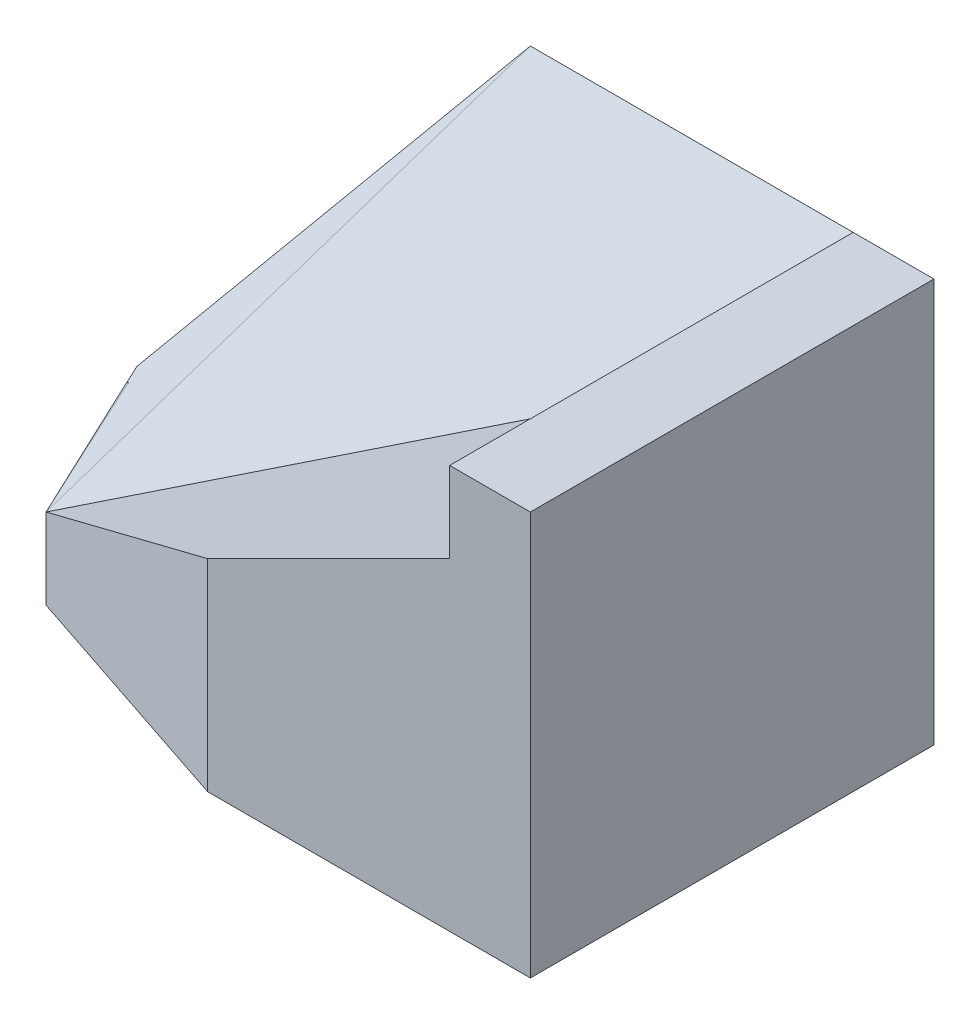
ISO-10303-21;
HEADER;
FILE_DESCRIPTION(('STEP AP214'),'2;1');
FILE_NAME('part.step','',(''),(''),'','','');
FILE_SCHEMA(('AUTOMOTIVE_DESIGN { 1 0 10303 214 1 1 1 1 }'));
ENDSEC;
DATA;
#1=APPLICATION_CONTEXT('core data for automotive mechanical design processes');
#2=APPLICATION_PROTOCOL_DEFINITION('international standard','automotive_design',2000,#1);
#3=PRODUCT_CONTEXT('',#1,'mechanical');
#4=PRODUCT('Part','Part','',(#3));
#5=PRODUCT_RELATED_PRODUCT_CATEGORY('part','',(#4));
#6=PRODUCT_DEFINITION_FORMATION('','',#4);
#7=PRODUCT_DEFINITION_CONTEXT('part definition',#1,'design');
#8=PRODUCT_DEFINITION('design','',#6,#7);
#9=PRODUCT_DEFINITION_SHAPE('','',#8);
#10=(LENGTH_UNIT() NAMED_UNIT(*) SI_UNIT(.MILLI.,.METRE.));
#11=(NAMED_UNIT(*) PLANE_ANGLE_UNIT() SI_UNIT($,.RADIAN.));
#12=(NAMED_UNIT(*) SI_UNIT($,.STERADIAN.) SOLID_ANGLE_UNIT());
#13=UNCERTAINTY_MEASURE_WITH_UNIT(LENGTH_MEASURE(1.E-05),#10,'distance_accuracy_value','');
#14=(GEOMETRIC_REPRESENTATION_CONTEXT(3) GLOBAL_UNCERTAINTY_ASSIGNED_CONTEXT((#13)) GLOBAL_UNIT_ASSIGNED_CONTEXT((#10,
#11,#12)) REPRESENTATION_CONTEXT('',''));
#15=CARTESIAN_POINT('',(0.,0.,0.));
#16=DIRECTION('',(0.,0.,1.));
#17=DIRECTION('',(1.,0.,0.));
#18=AXIS2_PLACEMENT_3D('',#15,#16,#17);
#19=CARTESIAN_POINT('',(-5.50335570469799,24.7651006711409,22.0134228187919));
#20=DIRECTION('',(-0.163846384103808,0.737308728467135,0.655385536415233));
#21=DIRECTION('',(0.,-0.664363838829921,0.747409318683659));
#22=AXIS2_PLACEMENT_3D('',#19,#20,#21);
#23=PLANE('',#22);
#24=DIRECTION('',(-0.011800004597994,-0.665781136294049,0.746053777181305));
#25=VECTOR('',#24,1.);
#26=CARTESIAN_POINT('',(0.00710124553415792,10.4006672439458,39.5510246619444));
#27=LINE('',#26,#25);
#28=CARTESIAN_POINT('',(0.158165603591972,18.9240368007981,30.));
#29=VERTEX_POINT('',#28);
#30=CARTESIAN_POINT('',(0.,9.99999999999988,40.));
#31=VERTEX_POINT('',#30);
#32=EDGE_CURVE('E11',#29,#31,#27,.T.);
#33=ORIENTED_EDGE('',*,*,#32,.T.);
#34=DIRECTION('',(0.333333333333332,0.666666666666668,-0.666666666666666));
#35=VECTOR('',#34,1.);
#36=CARTESIAN_POINT('',(0.,9.99999999999988,40.));
#37=LINE('',#36,#35);
#38=CARTESIAN_POINT('',(20.,50.,0.));
#39=VERTEX_POINT('',#38);
#40=EDGE_CURVE('E143',#31,#39,#37,.T.);
#41=ORIENTED_EDGE('',*,*,#40,.T.);
#42=DIRECTION('',(0.433701495857675,0.650552243786513,-0.623445900295406));
#43=VECTOR('',#42,1.);
#44=CARTESIAN_POINT('',(-5.98089639970615,11.0286554004408,37.3475385745774));
#45=LINE('',#44,#43);
#46=CARTESIAN_POINT('',(0.,20.,28.7499999999999));
#47=VERTEX_POINT('',#46);
#48=EDGE_CURVE('E171',#47,#39,#45,.T.);
#49=ORIENTED_EDGE('',*,*,#48,.F.);
#50=DIRECTION('',(0.,0.66436383882992,-0.74740931868366));
#51=VECTOR('',#50,1.);
#52=CARTESIAN_POINT('',(0.,0.62068965517235,50.551724137931));
#53=LINE('',#52,#51);
#54=CARTESIAN_POINT('',(0.,18.9240368007981,29.960458599102));
#55=VERTEX_POINT('',#54);
#56=EDGE_CURVE('E168',#55,#47,#53,.T.);
#57=ORIENTED_EDGE('',*,*,#56,.F.);
#58=DIRECTION('',(0.986217674376036,0.106936428031225,0.126250937058882));
#59=VECTOR('',#58,1.);
#60=CARTESIAN_POINT('',(-49.9882210842976,13.5037711279364,23.561202209997));
#61=LINE('',#60,#59);
#62=CARTESIAN_POINT('',(0.308880308880279,18.9575289575289,30.));
#63=VERTEX_POINT('',#62);
#64=EDGE_CURVE('E151',#55,#63,#61,.T.);
#65=ORIENTED_EDGE('',*,*,#64,.T.);
#66=DIRECTION('',(0.976187060183953,0.216930457818657,0.));
#67=VECTOR('',#66,1.);
#68=CARTESIAN_POINT('',(-3.99999999999999,17.9999999999999,30.));
#69=LINE('',#68,#67);
#70=EDGE_CURVE('E147',#29,#63,#69,.T.);
#71=ORIENTED_EDGE('',*,*,#70,.F.);
#72=EDGE_LOOP('',(#33,#41,#49,#57,#65,#71));
#73=FACE_BOUND('',#72,.T.);
#74=ADVANCED_FACE('F37',(#73),#23,.T.);
#75=CARTESIAN_POINT('',(0.,50.,50.));
#76=DIRECTION('',(0.,-1.,0.));
#77=DIRECTION('',(0.,0.,-1.));
#78=AXIS2_PLACEMENT_3D('',#75,#76,#77);
#79=PLANE('',#78);
#80=DIRECTION('',(0.,0.,-1.));
#81=VECTOR('',#80,1.);
#82=CARTESIAN_POINT('',(70.,50.,50.));
#83=LINE('',#82,#81);
#84=CARTESIAN_POINT('',(70.,50.,50.));
#85=VERTEX_POINT('',#84);
#86=CARTESIAN_POINT('',(70.,50.,0.));
#87=VERTEX_POINT('',#86);
#88=EDGE_CURVE('E92',#85,#87,#83,.T.);
#89=ORIENTED_EDGE('',*,*,#88,.T.);
#90=DIRECTION('',(-1.,0.,0.));
#91=VECTOR('',#90,1.);
#92=CARTESIAN_POINT('',(0.,50.,0.));
#93=LINE('',#92,#91);
#94=CARTESIAN_POINT('',(60.,50.,0.));
#95=VERTEX_POINT('',#94);
#96=EDGE_CURVE('E99',#87,#95,#93,.T.);
#97=ORIENTED_EDGE('',*,*,#96,.T.);
#98=DIRECTION('',(0.,0.,-1.));
#99=VECTOR('',#98,1.);
#100=CARTESIAN_POINT('',(60.,50.,0.));
#101=LINE('',#100,#99);
#102=CARTESIAN_POINT('',(60.,50.,50.));
#103=VERTEX_POINT('',#102);
#104=EDGE_CURVE('E187',#103,#95,#101,.T.);
#105=ORIENTED_EDGE('',*,*,#104,.F.);
#106=DIRECTION('',(-1.,0.,0.));
#107=VECTOR('',#106,1.);
#108=CARTESIAN_POINT('',(0.,50.,50.));
#109=LINE('',#108,#107);
#110=EDGE_CURVE('E107',#85,#103,#109,.T.);
#111=ORIENTED_EDGE('',*,*,#110,.F.);
#112=EDGE_LOOP('',(#89,#97,#105,#111));
#113=FACE_BOUND('',#112,.T.);
#114=ADVANCED_FACE('F221',(#113),#79,.F.);
#115=CARTESIAN_POINT('',(-9.23076923076924,6.15384615384616,30.));
#116=DIRECTION('',(0.832050294337844,-0.554700196225229,0.));
#117=DIRECTION('',(0.554700196225229,0.832050294337844,0.));
#118=AXIS2_PLACEMENT_3D('',#115,#116,#117);
#119=PLANE('',#118);
#120=DIRECTION('',(0.,0.,-1.));
#121=VECTOR('',#120,1.);
#122=CARTESIAN_POINT('',(0.,20.,30.));
#123=LINE('',#122,#121);
#124=CARTESIAN_POINT('',(0.,20.,0.));
#125=VERTEX_POINT('',#124);
#126=EDGE_CURVE('E176',#47,#125,#123,.T.);
#127=ORIENTED_EDGE('',*,*,#126,.F.);
#128=ORIENTED_EDGE('',*,*,#48,.T.);
#129=DIRECTION('',(-0.554700196225229,-0.832050294337844,0.));
#130=VECTOR('',#129,1.);
#131=CARTESIAN_POINT('',(-9.23076923076924,6.15384615384616,0.));
#132=LINE('',#131,#130);
#133=EDGE_CURVE('E173',#39,#125,#132,.T.);
#134=ORIENTED_EDGE('',*,*,#133,.T.);
#135=EDGE_LOOP('',(#127,#128,#134));
#136=FACE_BOUND('',#135,.T.);
#137=ADVANCED_FACE('F199',(#136),#119,.F.);
#138=CARTESIAN_POINT('',(0.,0.,30.));
#139=DIRECTION('',(0.,0.,-1.));
#140=DIRECTION('',(-1.,0.,0.));
#141=AXIS2_PLACEMENT_3D('',#138,#139,#140);
#142=PLANE('',#141);
#143=DIRECTION('',(-1.,0.,0.));
#144=VECTOR('',#143,1.);
#145=CARTESIAN_POINT('',(51.,18.9240368007981,30.));
#146=LINE('',#145,#144);
#147=CARTESIAN_POINT('',(0.,18.9240368007981,30.));
#148=VERTEX_POINT('',#147);
#149=EDGE_CURVE('E157',#29,#148,#146,.T.);
#150=ORIENTED_EDGE('',*,*,#149,.F.);
#151=ORIENTED_EDGE('',*,*,#70,.T.);
#152=DIRECTION('',(-0.994172709218196,-0.107798999279919,0.));
#153=VECTOR('',#152,1.);
#154=CARTESIAN_POINT('',(-2.02810460154871,18.7041276799233,30.));
#155=LINE('',#154,#153);
#156=EDGE_CURVE('E165',#63,#148,#155,.T.);
#157=ORIENTED_EDGE('',*,*,#156,.T.);
#158=EDGE_LOOP('',(#150,#151,#157));
#159=FACE_BOUND('',#158,.T.);
#160=ADVANCED_FACE('F207',(#159),#142,.F.);
#161=CARTESIAN_POINT('',(30.0000000000002,25.,0.));
#162=DIRECTION('',(-0.44721359549996,0.894427190999915,0.));
#163=DIRECTION('',(-0.894427190999915,-0.44721359549996,0.));
#164=AXIS2_PLACEMENT_3D('',#161,#162,#163);
#165=PLANE('',#164);
#166=DIRECTION('',(-0.816496580927725,-0.408248290463865,0.408248290463863));
#167=VECTOR('',#166,1.);
#168=CARTESIAN_POINT('',(60.,40.,10.));
#169=LINE('',#168,#167);
#170=CARTESIAN_POINT('',(60.,40.,10.));
#171=VERTEX_POINT('',#170);
#172=EDGE_CURVE('E155',#171,#31,#169,.T.);
#173=ORIENTED_EDGE('',*,*,#172,.T.);
#174=DIRECTION('',(-0.857142857142856,-0.42857142857143,-0.285714285714286));
#175=VECTOR('',#174,1.);
#176=CARTESIAN_POINT('',(17.7551020408165,18.8775510204081,45.9183673469388));
#177=LINE('',#176,#175);
#178=CARTESIAN_POINT('',(30.,24.9999999999999,50.));
#179=VERTEX_POINT('',#178);
#180=EDGE_CURVE('E45',#179,#31,#177,.T.);
#181=ORIENTED_EDGE('',*,*,#180,.F.);
#182=DIRECTION('',(-0.894427190999915,-0.44721359549996,0.));
#183=VECTOR('',#182,1.);
#184=CARTESIAN_POINT('',(30.0000000000002,25.,50.));
#185=LINE('',#184,#183);
#186=CARTESIAN_POINT('',(60.,40.,50.));
#187=VERTEX_POINT('',#186);
#188=EDGE_CURVE('E182',#187,#179,#185,.T.);
#189=ORIENTED_EDGE('',*,*,#188,.F.);
#190=DIRECTION('',(0.,0.,1.));
#191=VECTOR('',#190,1.);
#192=CARTESIAN_POINT('',(60.,40.,0.));
#193=LINE('',#192,#191);
#194=EDGE_CURVE('E184',#171,#187,#193,.T.);
#195=ORIENTED_EDGE('',*,*,#194,.F.);
#196=EDGE_LOOP('',(#173,#181,#189,#195));
#197=FACE_BOUND('',#196,.T.);
#198=ADVANCED_FACE('F231',(#197),#165,.T.);
#199=CARTESIAN_POINT('',(60.,20.,0.));
#200=DIRECTION('',(1.,0.,0.));
#201=DIRECTION('',(0.,0.,-1.));
#202=AXIS2_PLACEMENT_3D('',#199,#200,#201);
#203=PLANE('',#202);
#204=ORIENTED_EDGE('',*,*,#104,.T.);
#205=DIRECTION('',(0.,-0.707106781186548,0.707106781186547));
#206=VECTOR('',#205,1.);
#207=CARTESIAN_POINT('',(60.,25.,25.));
#208=LINE('',#207,#206);
#209=EDGE_CURVE('E456',#95,#171,#208,.T.);
#210=ORIENTED_EDGE('',*,*,#209,.T.);
#211=ORIENTED_EDGE('',*,*,#194,.T.);
#212=DIRECTION('',(0.,1.,0.));
#213=VECTOR('',#212,1.);
#214=CARTESIAN_POINT('',(60.,20.,50.));
#215=LINE('',#214,#213);
#216=EDGE_CURVE('E135',#187,#103,#215,.T.);
#217=ORIENTED_EDGE('',*,*,#216,.T.);
#218=EDGE_LOOP('',(#204,#210,#211,#217));
#219=FACE_BOUND('',#218,.T.);
#220=ADVANCED_FACE('F236',(#219),#203,.F.);
#221=CARTESIAN_POINT('',(0.,0.,50.));
#222=DIRECTION('',(1.,0.,0.));
#223=DIRECTION('',(0.,0.,-1.));
#224=AXIS2_PLACEMENT_3D('',#221,#222,#223);
#225=PLANE('',#224);
#226=DIRECTION('',(0.,-1.,0.));
#227=VECTOR('',#226,1.);
#228=CARTESIAN_POINT('',(0.,0.,0.));
#229=LINE('',#228,#227);
#230=CARTESIAN_POINT('',(0.,0.,0.));
#231=VERTEX_POINT('',#230);
#232=EDGE_CURVE('E85',#125,#231,#229,.T.);
#233=ORIENTED_EDGE('',*,*,#232,.T.);
#234=DIRECTION('',(0.,0.,-1.));
#235=VECTOR('',#234,1.);
#236=CARTESIAN_POINT('',(0.,0.,50.));
#237=LINE('',#236,#235);
#238=CARTESIAN_POINT('',(0.,0.,40.));
#239=VERTEX_POINT('',#238);
#240=EDGE_CURVE('E79',#239,#231,#237,.T.);
#241=ORIENTED_EDGE('',*,*,#240,.F.);
#242=DIRECTION('',(0.,-1.,0.));
#243=VECTOR('',#242,1.);
#244=CARTESIAN_POINT('',(0.,50.,40.));
#245=LINE('',#244,#243);
#246=EDGE_CURVE('E119',#31,#239,#245,.T.);
#247=ORIENTED_EDGE('',*,*,#246,.F.);
#248=DIRECTION('',(0.,0.665827492853956,-0.74610572291051));
#249=VECTOR('',#248,1.);
#250=CARTESIAN_POINT('',(0.,9.99999999999988,40.));
#251=LINE('',#250,#249);
#252=EDGE_CURVE('E134',#31,#148,#251,.T.);
#253=ORIENTED_EDGE('',*,*,#252,.T.);
#254=DIRECTION('',(0.,0.,-1.));
#255=VECTOR('',#254,1.);
#256=CARTESIAN_POINT('',(0.,18.924036800798,50.0000000000001));
#257=LINE('',#256,#255);
#258=EDGE_CURVE('E163',#148,#55,#257,.T.);
#259=ORIENTED_EDGE('',*,*,#258,.T.);
#260=ORIENTED_EDGE('',*,*,#56,.T.);
#261=ORIENTED_EDGE('',*,*,#126,.T.);
#262=EDGE_LOOP('',(#233,#241,#247,#253,#259,#260,#261));
#263=FACE_BOUND('',#262,.T.);
#264=ADVANCED_FACE('F39',(#263),#225,.F.);
#265=CARTESIAN_POINT('',(0.,0.,0.));
#266=DIRECTION('',(0.,0.,-1.));
#267=DIRECTION('',(-1.,0.,0.));
#268=AXIS2_PLACEMENT_3D('',#265,#266,#267);
#269=PLANE('',#268);
#270=ORIENTED_EDGE('',*,*,#133,.F.);
#271=EDGE_CURVE('E100',#95,#39,#93,.T.);
#272=ORIENTED_EDGE('',*,*,#271,.F.);
#273=ORIENTED_EDGE('',*,*,#96,.F.);
#274=DIRECTION('',(0.,1.,0.));
#275=VECTOR('',#274,1.);
#276=CARTESIAN_POINT('',(70.,0.,0.));
#277=LINE('',#276,#275);
#278=CARTESIAN_POINT('',(70.,0.,0.));
#279=VERTEX_POINT('',#278);
#280=EDGE_CURVE('E84',#279,#87,#277,.T.);
#281=ORIENTED_EDGE('',*,*,#280,.F.);
#282=DIRECTION('',(1.,0.,0.));
#283=VECTOR('',#282,1.);
#284=CARTESIAN_POINT('',(0.,0.,0.));
#285=LINE('',#284,#283);
#286=EDGE_CURVE('E72',#231,#279,#285,.T.);
#287=ORIENTED_EDGE('',*,*,#286,.F.);
#288=ORIENTED_EDGE('',*,*,#232,.F.);
#289=EDGE_LOOP('',(#270,#272,#273,#281,#287,#288));
#290=FACE_BOUND('',#289,.T.);
#291=ADVANCED_FACE('F96',(#290),#269,.T.);
#292=CARTESIAN_POINT('',(0.,50.,40.));
#293=DIRECTION('',(0.316227766016838,0.,-0.948683298050514));
#294=DIRECTION('',(-0.948683298050514,0.,-0.316227766016838));
#295=AXIS2_PLACEMENT_3D('',#292,#293,#294);
#296=PLANE('',#295);
#297=ORIENTED_EDGE('',*,*,#180,.T.);
#298=ORIENTED_EDGE('',*,*,#246,.T.);
#299=DIRECTION('',(0.948683298050514,0.,0.316227766016838));
#300=VECTOR('',#299,1.);
#301=CARTESIAN_POINT('',(0.,0.,40.));
#302=LINE('',#301,#300);
#303=CARTESIAN_POINT('',(30.,0.,50.));
#304=VERTEX_POINT('',#303);
#305=EDGE_CURVE('E179',#239,#304,#302,.T.);
#306=ORIENTED_EDGE('',*,*,#305,.T.);
#307=DIRECTION('',(0.,-1.,0.));
#308=VECTOR('',#307,1.);
#309=CARTESIAN_POINT('',(30.,50.,50.));
#310=LINE('',#309,#308);
#311=EDGE_CURVE('E122',#179,#304,#310,.T.);
#312=ORIENTED_EDGE('',*,*,#311,.F.);
#313=EDGE_LOOP('',(#297,#298,#306,#312));
#314=FACE_BOUND('',#313,.T.);
#315=ADVANCED_FACE('F116',(#314),#296,.F.);
#316=CARTESIAN_POINT('',(0.,0.,50.));
#317=DIRECTION('',(0.,1.,0.));
#318=DIRECTION('',(0.,0.,1.));
#319=AXIS2_PLACEMENT_3D('',#316,#317,#318);
#320=PLANE('',#319);
#321=ORIENTED_EDGE('',*,*,#240,.T.);
#322=ORIENTED_EDGE('',*,*,#286,.T.);
#323=DIRECTION('',(0.,0.,-1.));
#324=VECTOR('',#323,1.);
#325=CARTESIAN_POINT('',(70.,0.,50.));
#326=LINE('',#325,#324);
#327=CARTESIAN_POINT('',(70.,0.,50.));
#328=VERTEX_POINT('',#327);
#329=EDGE_CURVE('E76',#328,#279,#326,.T.);
#330=ORIENTED_EDGE('',*,*,#329,.F.);
#331=DIRECTION('',(1.,0.,0.));
#332=VECTOR('',#331,1.);
#333=CARTESIAN_POINT('',(0.,0.,50.));
#334=LINE('',#333,#332);
#335=EDGE_CURVE('E106',#304,#328,#334,.T.);
#336=ORIENTED_EDGE('',*,*,#335,.F.);
#337=ORIENTED_EDGE('',*,*,#305,.F.);
#338=EDGE_LOOP('',(#321,#322,#330,#336,#337));
#339=FACE_BOUND('',#338,.T.);
#340=ADVANCED_FACE('F74',(#339),#320,.F.);
#341=CARTESIAN_POINT('',(70.,0.,50.));
#342=DIRECTION('',(-1.,0.,0.));
#343=DIRECTION('',(0.,0.,1.));
#344=AXIS2_PLACEMENT_3D('',#341,#342,#343);
#345=PLANE('',#344);
#346=ORIENTED_EDGE('',*,*,#280,.T.);
#347=ORIENTED_EDGE('',*,*,#88,.F.);
#348=DIRECTION('',(0.,1.,0.));
#349=VECTOR('',#348,1.);
#350=CARTESIAN_POINT('',(70.,0.,50.));
#351=LINE('',#350,#349);
#352=EDGE_CURVE('E59',#328,#85,#351,.T.);
#353=ORIENTED_EDGE('',*,*,#352,.F.);
#354=ORIENTED_EDGE('',*,*,#329,.T.);
#355=EDGE_LOOP('',(#346,#347,#353,#354));
#356=FACE_BOUND('',#355,.T.);
#357=ADVANCED_FACE('F89',(#356),#345,.F.);
#358=CARTESIAN_POINT('',(0.,0.,50.));
#359=DIRECTION('',(0.,0.,-1.));
#360=DIRECTION('',(-1.,0.,0.));
#361=AXIS2_PLACEMENT_3D('',#358,#359,#360);
#362=PLANE('',#361);
#363=ORIENTED_EDGE('',*,*,#188,.T.);
#364=ORIENTED_EDGE('',*,*,#311,.T.);
#365=ORIENTED_EDGE('',*,*,#335,.T.);
#366=ORIENTED_EDGE('',*,*,#352,.T.);
#367=ORIENTED_EDGE('',*,*,#110,.T.);
#368=ORIENTED_EDGE('',*,*,#216,.F.);
#369=EDGE_LOOP('',(#363,#364,#365,#366,#367,#368));
#370=FACE_BOUND('',#369,.T.);
#371=ADVANCED_FACE('F218',(#370),#362,.F.);
#372=CARTESIAN_POINT('',(-6.40127704299534,18.2299408424697,80.552373793325));
#373=DIRECTION('',(0.107798999279919,-0.994172709218196,0.));
#374=DIRECTION('',(0.994172709218196,0.107798999279919,0.));
#375=AXIS2_PLACEMENT_3D('',#372,#373,#374);
#376=PLANE('',#375);
#377=ORIENTED_EDGE('',*,*,#64,.F.);
#378=ORIENTED_EDGE('',*,*,#258,.F.);
#379=ORIENTED_EDGE('',*,*,#156,.F.);
#380=EDGE_LOOP('',(#377,#378,#379));
#381=FACE_BOUND('',#380,.T.);
#382=ADVANCED_FACE('F205',(#381),#376,.F.);
#383=CARTESIAN_POINT('',(51.,9.99999999999988,40.));
#384=DIRECTION('',(0.,0.74610572291051,0.665827492853956));
#385=DIRECTION('',(0.,-0.665827492853956,0.74610572291051));
#386=AXIS2_PLACEMENT_3D('',#383,#384,#385);
#387=PLANE('',#386);
#388=ORIENTED_EDGE('',*,*,#32,.F.);
#389=ORIENTED_EDGE('',*,*,#149,.T.);
#390=ORIENTED_EDGE('',*,*,#252,.F.);
#391=EDGE_LOOP('',(#388,#389,#390));
#392=FACE_BOUND('',#391,.T.);
#393=ADVANCED_FACE('F208',(#392),#387,.T.);
#394=CARTESIAN_POINT('',(0.,24.9999999999999,25.));
#395=DIRECTION('',(0.,0.707106781186547,0.707106781186548));
#396=DIRECTION('',(0.,-0.707106781186548,0.707106781186547));
#397=AXIS2_PLACEMENT_3D('',#394,#395,#396);
#398=PLANE('',#397);
#399=ORIENTED_EDGE('',*,*,#209,.F.);
#400=ORIENTED_EDGE('',*,*,#271,.T.);
#401=ORIENTED_EDGE('',*,*,#40,.F.);
#402=ORIENTED_EDGE('',*,*,#172,.F.);
#403=EDGE_LOOP('',(#399,#400,#401,#402));
#404=FACE_BOUND('',#403,.T.);
#405=ADVANCED_FACE('F210',(#404),#398,.T.);
#406=CLOSED_SHELL('',(#74,#114,#137,#160,#198,#220,#264,#291,#315,#340,#357,#371,#382,#393,#405));
#407=MANIFOLD_SOLID_BREP('B2',#406);
#408=ADVANCED_BREP_SHAPE_REPRESENTATION('',(#18,#407),#14);
#409=SHAPE_DEFINITION_REPRESENTATION(#9,#408);
ENDSEC;
END-ISO-10303-21;
